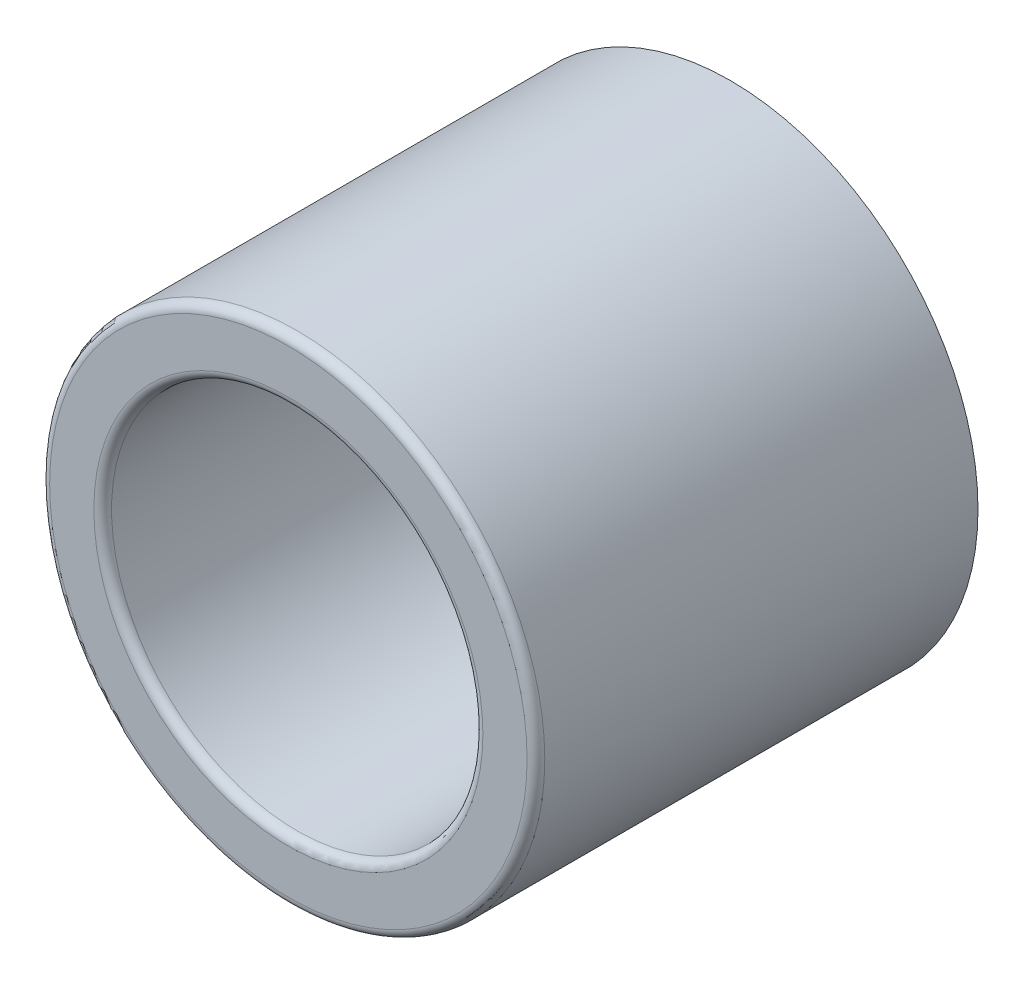
ISO-10303-21;
HEADER;
FILE_DESCRIPTION(('STEP AP214'),'2;1');
FILE_NAME('part.step','',(''),(''),'','','');
FILE_SCHEMA(('AUTOMOTIVE_DESIGN { 1 0 10303 214 1 1 1 1 }'));
ENDSEC;
DATA;
#1=APPLICATION_CONTEXT('core data for automotive mechanical design processes');
#2=APPLICATION_PROTOCOL_DEFINITION('international standard','automotive_design',2000,#1);
#3=PRODUCT_CONTEXT('',#1,'mechanical');
#4=PRODUCT('Part','Part','',(#3));
#5=PRODUCT_RELATED_PRODUCT_CATEGORY('part','',(#4));
#6=PRODUCT_DEFINITION_FORMATION('','',#4);
#7=PRODUCT_DEFINITION_CONTEXT('part definition',#1,'design');
#8=PRODUCT_DEFINITION('design','',#6,#7);
#9=PRODUCT_DEFINITION_SHAPE('','',#8);
#10=(LENGTH_UNIT() NAMED_UNIT(*) SI_UNIT(.MILLI.,.METRE.));
#11=(NAMED_UNIT(*) PLANE_ANGLE_UNIT() SI_UNIT($,.RADIAN.));
#12=(NAMED_UNIT(*) SI_UNIT($,.STERADIAN.) SOLID_ANGLE_UNIT());
#13=UNCERTAINTY_MEASURE_WITH_UNIT(LENGTH_MEASURE(1.E-05),#10,'distance_accuracy_value','');
#14=(GEOMETRIC_REPRESENTATION_CONTEXT(3) GLOBAL_UNCERTAINTY_ASSIGNED_CONTEXT((#13)) GLOBAL_UNIT_ASSIGNED_CONTEXT((#10,
#11,#12)) REPRESENTATION_CONTEXT('',''));
#15=CARTESIAN_POINT('',(0.,0.,0.));
#16=DIRECTION('',(0.,0.,1.));
#17=DIRECTION('',(1.,0.,0.));
#18=AXIS2_PLACEMENT_3D('',#15,#16,#17);
#19=CARTESIAN_POINT('',(0.,0.,5.));
#20=DIRECTION('',(0.,0.,1.));
#21=DIRECTION('',(1.,0.,0.));
#22=AXIS2_PLACEMENT_3D('',#19,#20,#21);
#23=PLANE('',#22);
#24=CARTESIAN_POINT('',(0.,0.,5.));
#25=DIRECTION('',(0.,0.,1.));
#26=DIRECTION('',(1.,0.,0.));
#27=AXIS2_PLACEMENT_3D('',#24,#25,#26);
#28=CIRCLE('',#27,2.2);
#29=CARTESIAN_POINT('',(2.2,0.,5.));
#30=VERTEX_POINT('',#29);
#31=EDGE_CURVE('E40',#30,#30,#28,.F.);
#32=ORIENTED_EDGE('',*,*,#31,.T.);
#33=EDGE_LOOP('',(#32));
#34=FACE_BOUND('',#33,.T.);
#35=CARTESIAN_POINT('',(0.,0.,5.));
#36=DIRECTION('',(0.,0.,1.));
#37=DIRECTION('',(1.,0.,0.));
#38=AXIS2_PLACEMENT_3D('',#35,#36,#37);
#39=CIRCLE('',#38,2.7);
#40=CARTESIAN_POINT('',(2.7,0.,5.));
#41=VERTEX_POINT('',#40);
#42=EDGE_CURVE('E44',#41,#41,#39,.T.);
#43=ORIENTED_EDGE('',*,*,#42,.T.);
#44=EDGE_LOOP('',(#43));
#45=FACE_BOUND('',#44,.T.);
#46=ADVANCED_FACE('F33',(#34,#45),#23,.T.);
#47=CARTESIAN_POINT('',(0.,0.,0.));
#48=DIRECTION('',(0.,0.,1.));
#49=DIRECTION('',(1.,0.,0.));
#50=AXIS2_PLACEMENT_3D('',#47,#48,#49);
#51=PLANE('',#50);
#52=CARTESIAN_POINT('',(0.,0.,0.));
#53=DIRECTION('',(0.,0.,1.));
#54=DIRECTION('',(1.,0.,0.));
#55=AXIS2_PLACEMENT_3D('',#52,#53,#54);
#56=CIRCLE('',#55,2.8);
#57=CARTESIAN_POINT('',(2.8,0.,0.));
#58=VERTEX_POINT('',#57);
#59=EDGE_CURVE('E53',#58,#58,#56,.T.);
#60=ORIENTED_EDGE('',*,*,#59,.F.);
#61=EDGE_LOOP('',(#60));
#62=FACE_BOUND('',#61,.T.);
#63=CARTESIAN_POINT('',(0.,0.,0.));
#64=DIRECTION('',(0.,0.,1.));
#65=DIRECTION('',(1.,0.,0.));
#66=AXIS2_PLACEMENT_3D('',#63,#64,#65);
#67=CIRCLE('',#66,2.1);
#68=CARTESIAN_POINT('',(2.1,0.,0.));
#69=VERTEX_POINT('',#68);
#70=EDGE_CURVE('E56',#69,#69,#67,.T.);
#71=ORIENTED_EDGE('',*,*,#70,.T.);
#72=EDGE_LOOP('',(#71));
#73=FACE_BOUND('',#72,.T.);
#74=ADVANCED_FACE('F60',(#62,#73),#51,.F.);
#75=CARTESIAN_POINT('',(0.,0.,5.));
#76=DIRECTION('',(0.,0.,-1.));
#77=DIRECTION('',(-1.,0.,0.));
#78=AXIS2_PLACEMENT_3D('',#75,#76,#77);
#79=CYLINDRICAL_SURFACE('',#78,2.8);
#80=CARTESIAN_POINT('',(0.,0.,4.9));
#81=DIRECTION('',(0.,0.,1.));
#82=DIRECTION('',(1.,0.,0.));
#83=AXIS2_PLACEMENT_3D('',#80,#81,#82);
#84=CIRCLE('',#83,2.8);
#85=CARTESIAN_POINT('',(2.8,0.,4.9));
#86=VERTEX_POINT('',#85);
#87=EDGE_CURVE('E10',#86,#86,#84,.F.);
#88=ORIENTED_EDGE('',*,*,#87,.T.);
#89=EDGE_LOOP('',(#88));
#90=FACE_BOUND('',#89,.T.);
#91=ORIENTED_EDGE('',*,*,#59,.T.);
#92=EDGE_LOOP('',(#91));
#93=FACE_BOUND('',#92,.T.);
#94=ADVANCED_FACE('F65',(#90,#93),#79,.T.);
#95=CARTESIAN_POINT('',(0.,0.,5.));
#96=DIRECTION('',(0.,0.,-1.));
#97=DIRECTION('',(-1.,0.,0.));
#98=AXIS2_PLACEMENT_3D('',#95,#96,#97);
#99=CYLINDRICAL_SURFACE('',#98,2.1);
#100=CARTESIAN_POINT('',(0.,0.,4.9));
#101=DIRECTION('',(0.,0.,1.));
#102=DIRECTION('',(1.,0.,0.));
#103=AXIS2_PLACEMENT_3D('',#100,#101,#102);
#104=CIRCLE('',#103,2.1);
#105=CARTESIAN_POINT('',(2.1,0.,4.9));
#106=VERTEX_POINT('',#105);
#107=EDGE_CURVE('E48',#106,#106,#104,.T.);
#108=ORIENTED_EDGE('',*,*,#107,.T.);
#109=EDGE_LOOP('',(#108));
#110=FACE_BOUND('',#109,.T.);
#111=ORIENTED_EDGE('',*,*,#70,.F.);
#112=EDGE_LOOP('',(#111));
#113=FACE_BOUND('',#112,.T.);
#114=ADVANCED_FACE('F62',(#110,#113),#99,.F.);
#115=CARTESIAN_POINT('',(0.,0.,4.9));
#116=DIRECTION('',(0.,0.,1.));
#117=DIRECTION('',(1.,0.,0.));
#118=AXIS2_PLACEMENT_3D('',#115,#116,#117);
#119=TOROIDAL_SURFACE('',#118,2.2,0.1);
#120=ORIENTED_EDGE('',*,*,#31,.F.);
#121=EDGE_LOOP('',(#120));
#122=FACE_BOUND('',#121,.T.);
#123=ORIENTED_EDGE('',*,*,#107,.F.);
#124=EDGE_LOOP('',(#123));
#125=FACE_BOUND('',#124,.T.);
#126=ADVANCED_FACE('F64',(#122,#125),#119,.T.);
#127=CARTESIAN_POINT('',(0.,0.,4.9));
#128=DIRECTION('',(0.,0.,1.));
#129=DIRECTION('',(1.,0.,0.));
#130=AXIS2_PLACEMENT_3D('',#127,#128,#129);
#131=TOROIDAL_SURFACE('',#130,2.7,0.1);
#132=ORIENTED_EDGE('',*,*,#87,.F.);
#133=EDGE_LOOP('',(#132));
#134=FACE_BOUND('',#133,.T.);
#135=ORIENTED_EDGE('',*,*,#42,.F.);
#136=EDGE_LOOP('',(#135));
#137=FACE_BOUND('',#136,.T.);
#138=ADVANCED_FACE('F35',(#134,#137),#131,.T.);
#139=CLOSED_SHELL('',(#46,#74,#94,#114,#126,#138));
#140=MANIFOLD_SOLID_BREP('B2',#139);
#141=ADVANCED_BREP_SHAPE_REPRESENTATION('',(#18,#140),#14);
#142=SHAPE_DEFINITION_REPRESENTATION(#9,#141);
ENDSEC;
END-ISO-10303-21;
